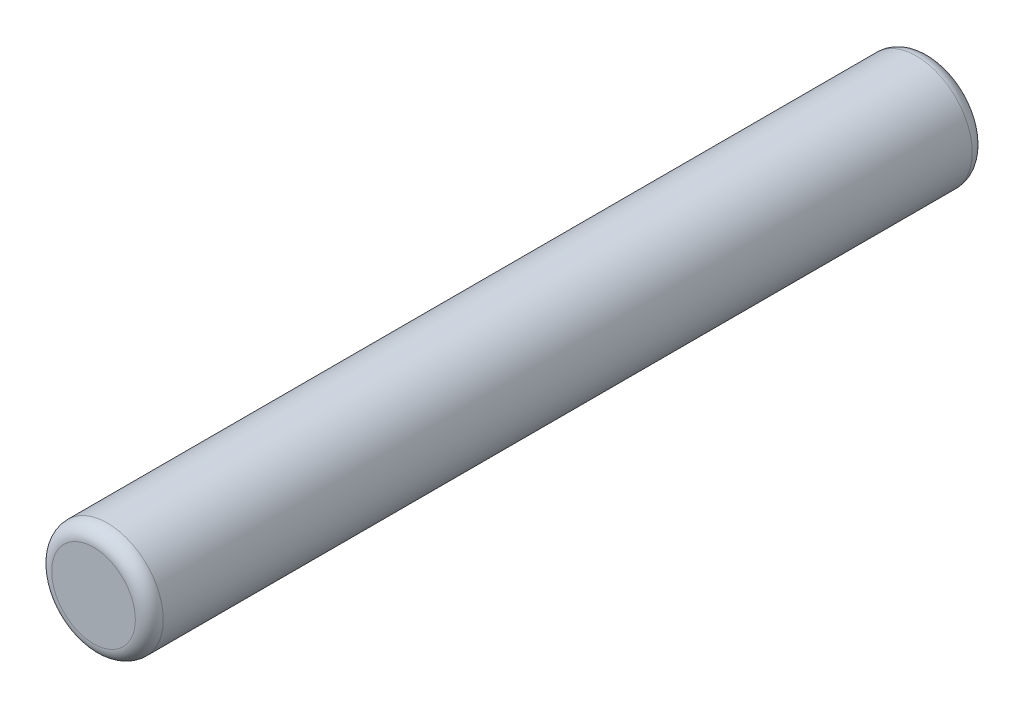
ISO-10303-21;
HEADER;
FILE_DESCRIPTION(('STEP AP214'),'2;1');
FILE_NAME('part.step','',(''),(''),'','','');
FILE_SCHEMA(('AUTOMOTIVE_DESIGN { 1 0 10303 214 1 1 1 1 }'));
ENDSEC;
DATA;
#1=APPLICATION_CONTEXT('core data for automotive mechanical design processes');
#2=APPLICATION_PROTOCOL_DEFINITION('international standard','automotive_design',2000,#1);
#3=PRODUCT_CONTEXT('',#1,'mechanical');
#4=PRODUCT('Part','Part','',(#3));
#5=PRODUCT_RELATED_PRODUCT_CATEGORY('part','',(#4));
#6=PRODUCT_DEFINITION_FORMATION('','',#4);
#7=PRODUCT_DEFINITION_CONTEXT('part definition',#1,'design');
#8=PRODUCT_DEFINITION('design','',#6,#7);
#9=PRODUCT_DEFINITION_SHAPE('','',#8);
#10=(LENGTH_UNIT() NAMED_UNIT(*) SI_UNIT(.MILLI.,.METRE.));
#11=(NAMED_UNIT(*) PLANE_ANGLE_UNIT() SI_UNIT($,.RADIAN.));
#12=(NAMED_UNIT(*) SI_UNIT($,.STERADIAN.) SOLID_ANGLE_UNIT());
#13=UNCERTAINTY_MEASURE_WITH_UNIT(LENGTH_MEASURE(1.E-05),#10,'distance_accuracy_value','');
#14=(GEOMETRIC_REPRESENTATION_CONTEXT(3) GLOBAL_UNCERTAINTY_ASSIGNED_CONTEXT((#13)) GLOBAL_UNIT_ASSIGNED_CONTEXT((#10,
#11,#12)) REPRESENTATION_CONTEXT('',''));
#15=CARTESIAN_POINT('',(0.,0.,0.));
#16=DIRECTION('',(0.,0.,1.));
#17=DIRECTION('',(1.,0.,0.));
#18=AXIS2_PLACEMENT_3D('',#15,#16,#17);
#19=CARTESIAN_POINT('',(0.,0.,15.));
#20=DIRECTION('',(0.,0.,-1.));
#21=DIRECTION('',(-1.,0.,0.));
#22=AXIS2_PLACEMENT_3D('',#19,#20,#21);
#23=CYLINDRICAL_SURFACE('',#22,2.);
#24=CARTESIAN_POINT('',(0.,0.,-14.5));
#25=DIRECTION('',(0.,0.,1.));
#26=DIRECTION('',(1.,0.,0.));
#27=AXIS2_PLACEMENT_3D('',#24,#25,#26);
#28=CIRCLE('',#27,2.);
#29=CARTESIAN_POINT('',(2.,0.,-14.5));
#30=VERTEX_POINT('',#29);
#31=EDGE_CURVE('E41',#30,#30,#28,.T.);
#32=ORIENTED_EDGE('',*,*,#31,.T.);
#33=EDGE_LOOP('',(#32));
#34=FACE_BOUND('',#33,.T.);
#35=CARTESIAN_POINT('',(0.,0.,14.5));
#36=DIRECTION('',(0.,0.,1.));
#37=DIRECTION('',(1.,0.,0.));
#38=AXIS2_PLACEMENT_3D('',#35,#36,#37);
#39=CIRCLE('',#38,2.);
#40=CARTESIAN_POINT('',(2.,0.,14.5));
#41=VERTEX_POINT('',#40);
#42=EDGE_CURVE('E45',#41,#41,#39,.F.);
#43=ORIENTED_EDGE('',*,*,#42,.T.);
#44=EDGE_LOOP('',(#43));
#45=FACE_BOUND('',#44,.T.);
#46=ADVANCED_FACE('F30',(#34,#45),#23,.T.);
#47=CARTESIAN_POINT('',(0.,0.,15.));
#48=DIRECTION('',(0.,0.,1.));
#49=DIRECTION('',(1.,0.,0.));
#50=AXIS2_PLACEMENT_3D('',#47,#48,#49);
#51=PLANE('',#50);
#52=CARTESIAN_POINT('',(0.,0.,15.));
#53=DIRECTION('',(0.,0.,1.));
#54=DIRECTION('',(1.,0.,0.));
#55=AXIS2_PLACEMENT_3D('',#52,#53,#54);
#56=CIRCLE('',#55,1.5);
#57=CARTESIAN_POINT('',(1.5,0.,15.));
#58=VERTEX_POINT('',#57);
#59=EDGE_CURVE('E10',#58,#58,#56,.T.);
#60=ORIENTED_EDGE('',*,*,#59,.T.);
#61=EDGE_LOOP('',(#60));
#62=FACE_BOUND('',#61,.T.);
#63=ADVANCED_FACE('F61',(#62),#51,.T.);
#64=CARTESIAN_POINT('',(0.,0.,-15.));
#65=DIRECTION('',(0.,0.,1.));
#66=DIRECTION('',(1.,0.,0.));
#67=AXIS2_PLACEMENT_3D('',#64,#65,#66);
#68=PLANE('',#67);
#69=CARTESIAN_POINT('',(0.,0.,-15.));
#70=DIRECTION('',(0.,0.,1.));
#71=DIRECTION('',(1.,0.,0.));
#72=AXIS2_PLACEMENT_3D('',#69,#70,#71);
#73=CIRCLE('',#72,1.5);
#74=CARTESIAN_POINT('',(1.5,0.,-15.));
#75=VERTEX_POINT('',#74);
#76=EDGE_CURVE('E37',#75,#75,#73,.F.);
#77=ORIENTED_EDGE('',*,*,#76,.T.);
#78=EDGE_LOOP('',(#77));
#79=FACE_BOUND('',#78,.T.);
#80=ADVANCED_FACE('F58',(#79),#68,.F.);
#81=CARTESIAN_POINT('',(0.,0.,-14.5));
#82=DIRECTION('',(0.,0.,1.));
#83=DIRECTION('',(1.,0.,0.));
#84=AXIS2_PLACEMENT_3D('',#81,#82,#83);
#85=TOROIDAL_SURFACE('',#84,1.5,0.5);
#86=ORIENTED_EDGE('',*,*,#76,.F.);
#87=EDGE_LOOP('',(#86));
#88=FACE_BOUND('',#87,.T.);
#89=ORIENTED_EDGE('',*,*,#31,.F.);
#90=EDGE_LOOP('',(#89));
#91=FACE_BOUND('',#90,.T.);
#92=ADVANCED_FACE('F54',(#88,#91),#85,.T.);
#93=CARTESIAN_POINT('',(0.,0.,14.5));
#94=DIRECTION('',(0.,0.,1.));
#95=DIRECTION('',(1.,0.,0.));
#96=AXIS2_PLACEMENT_3D('',#93,#94,#95);
#97=TOROIDAL_SURFACE('',#96,1.5,0.5);
#98=ORIENTED_EDGE('',*,*,#42,.F.);
#99=EDGE_LOOP('',(#98));
#100=FACE_BOUND('',#99,.T.);
#101=ORIENTED_EDGE('',*,*,#59,.F.);
#102=EDGE_LOOP('',(#101));
#103=FACE_BOUND('',#102,.T.);
#104=ADVANCED_FACE('F32',(#100,#103),#97,.T.);
#105=CLOSED_SHELL('',(#46,#63,#80,#92,#104));
#106=MANIFOLD_SOLID_BREP('B2',#105);
#107=ADVANCED_BREP_SHAPE_REPRESENTATION('',(#18,#106),#14);
#108=SHAPE_DEFINITION_REPRESENTATION(#9,#107);
ENDSEC;
END-ISO-10303-21;
